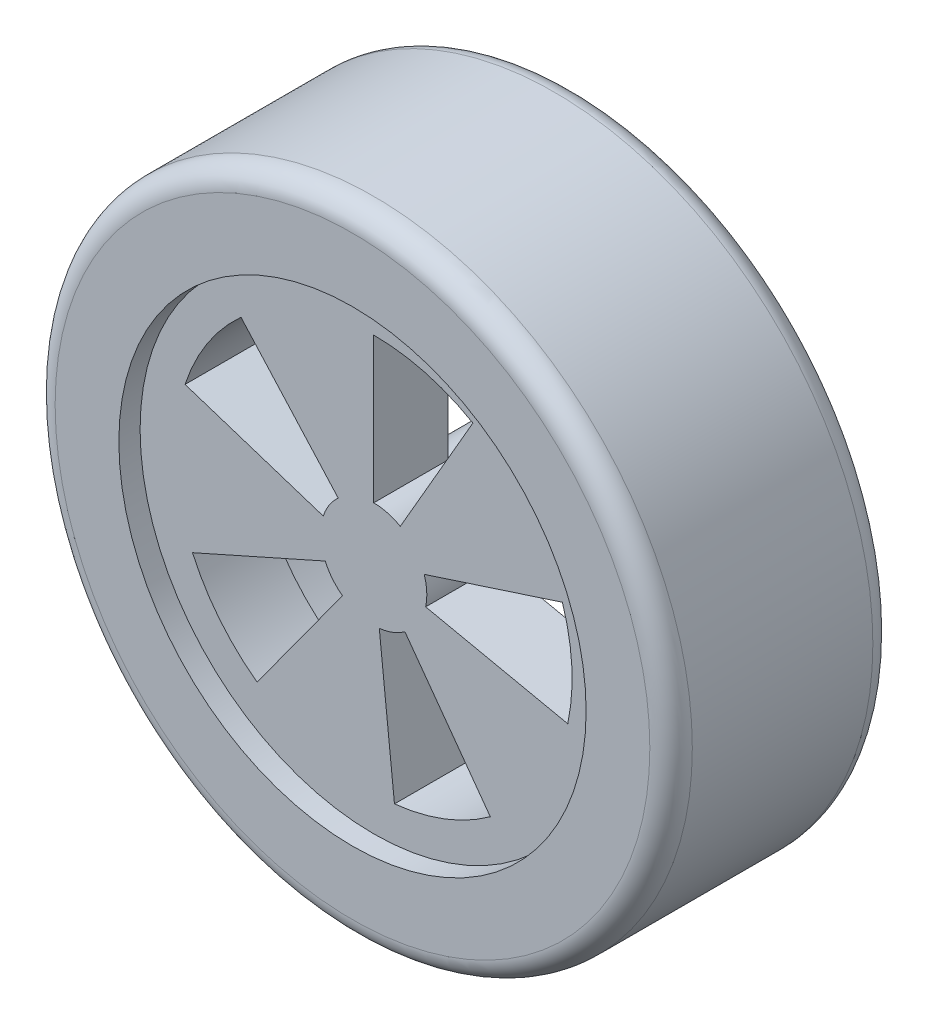
ISO-10303-21;
HEADER;
FILE_DESCRIPTION(('STEP AP214'),'2;1');
FILE_NAME('part.step','',(''),(''),'','','');
FILE_SCHEMA(('AUTOMOTIVE_DESIGN { 1 0 10303 214 1 1 1 1 }'));
ENDSEC;
DATA;
#1=APPLICATION_CONTEXT('core data for automotive mechanical design processes');
#2=APPLICATION_PROTOCOL_DEFINITION('international standard','automotive_design',2000,#1);
#3=PRODUCT_CONTEXT('',#1,'mechanical');
#4=PRODUCT('Part','Part','',(#3));
#5=PRODUCT_RELATED_PRODUCT_CATEGORY('part','',(#4));
#6=PRODUCT_DEFINITION_FORMATION('','',#4);
#7=PRODUCT_DEFINITION_CONTEXT('part definition',#1,'design');
#8=PRODUCT_DEFINITION('design','',#6,#7);
#9=PRODUCT_DEFINITION_SHAPE('','',#8);
#10=(LENGTH_UNIT() NAMED_UNIT(*) SI_UNIT(.MILLI.,.METRE.));
#11=(NAMED_UNIT(*) PLANE_ANGLE_UNIT() SI_UNIT($,.RADIAN.));
#12=(NAMED_UNIT(*) SI_UNIT($,.STERADIAN.) SOLID_ANGLE_UNIT());
#13=UNCERTAINTY_MEASURE_WITH_UNIT(LENGTH_MEASURE(1.E-05),#10,'distance_accuracy_value','');
#14=(GEOMETRIC_REPRESENTATION_CONTEXT(3) GLOBAL_UNCERTAINTY_ASSIGNED_CONTEXT((#13)) GLOBAL_UNIT_ASSIGNED_CONTEXT((#10,
#11,#12)) REPRESENTATION_CONTEXT('',''));
#15=CARTESIAN_POINT('',(0.,0.,0.));
#16=DIRECTION('',(0.,0.,1.));
#17=DIRECTION('',(1.,0.,0.));
#18=AXIS2_PLACEMENT_3D('',#15,#16,#17);
#19=CARTESIAN_POINT('',(0.,0.,10.5));
#20=DIRECTION('',(0.,0.,-1.));
#21=DIRECTION('',(-1.,0.,0.));
#22=AXIS2_PLACEMENT_3D('',#19,#20,#21);
#23=CYLINDRICAL_SURFACE('',#22,14.9999999999997);
#24=CARTESIAN_POINT('',(0.,0.,0.999999999999999));
#25=DIRECTION('',(0.,0.,1.));
#26=DIRECTION('',(1.,0.,0.));
#27=AXIS2_PLACEMENT_3D('',#24,#25,#26);
#28=CIRCLE('',#27,14.9999999999997);
#29=CARTESIAN_POINT('',(-14.9999999999997,0.,0.999999999999997));
#30=VERTEX_POINT('',#29);
#31=EDGE_CURVE('E339',#30,#30,#28,.T.);
#32=CARTESIAN_POINT('',(0.,0.,9.5));
#33=DIRECTION('',(0.,0.,1.));
#34=DIRECTION('',(1.,0.,0.));
#35=AXIS2_PLACEMENT_3D('',#32,#33,#34);
#36=CIRCLE('',#35,14.9999999999997);
#37=CARTESIAN_POINT('',(-14.9999999999997,0.,9.5));
#38=VERTEX_POINT('',#37);
#39=EDGE_CURVE('E334',#38,#38,#36,.F.);
#40=CARTESIAN_POINT('',(-14.9999999999997,0.,0.999999999999997));
#41=CARTESIAN_POINT('',(-14.9999999999997,0.,1.08854166666666));
#42=CARTESIAN_POINT('',(-14.9999999999997,0.,1.17708333333333));
#43=CARTESIAN_POINT('',(-14.9999999999997,0.,1.35416666666666));
#44=CARTESIAN_POINT('',(-14.9999999999997,0.,1.44270833333333));
#45=CARTESIAN_POINT('',(-14.9999999999997,0.,1.61979166666666));
#46=CARTESIAN_POINT('',(-14.9999999999997,0.,1.70833333333333));
#47=CARTESIAN_POINT('',(-14.9999999999997,0.,1.88541666666666));
#48=CARTESIAN_POINT('',(-14.9999999999997,0.,1.97395833333333));
#49=CARTESIAN_POINT('',(-14.9999999999997,0.,2.15104166666667));
#50=CARTESIAN_POINT('',(-14.9999999999997,0.,2.23958333333333));
#51=CARTESIAN_POINT('',(-14.9999999999997,0.,2.41666666666667));
#52=CARTESIAN_POINT('',(-14.9999999999997,0.,2.50520833333333));
#53=CARTESIAN_POINT('',(-14.9999999999997,0.,2.68229166666666));
#54=CARTESIAN_POINT('',(-14.9999999999997,0.,2.77083333333333));
#55=CARTESIAN_POINT('',(-14.9999999999997,0.,2.94791666666666));
#56=CARTESIAN_POINT('',(-14.9999999999997,0.,3.03645833333333));
#57=CARTESIAN_POINT('',(-14.9999999999997,0.,3.21354166666666));
#58=CARTESIAN_POINT('',(-14.9999999999997,0.,3.30208333333333));
#59=CARTESIAN_POINT('',(-14.9999999999997,0.,3.47916666666666));
#60=CARTESIAN_POINT('',(-14.9999999999997,0.,3.56770833333333));
#61=CARTESIAN_POINT('',(-14.9999999999997,0.,3.74479166666666));
#62=CARTESIAN_POINT('',(-14.9999999999997,0.,3.83333333333333));
#63=CARTESIAN_POINT('',(-14.9999999999997,0.,4.01041666666666));
#64=CARTESIAN_POINT('',(-14.9999999999997,0.,4.09895833333333));
#65=CARTESIAN_POINT('',(-14.9999999999997,0.,4.27604166666666));
#66=CARTESIAN_POINT('',(-14.9999999999997,0.,4.36458333333333));
#67=CARTESIAN_POINT('',(-14.9999999999997,0.,4.54166666666666));
#68=CARTESIAN_POINT('',(-14.9999999999997,0.,4.63020833333333));
#69=CARTESIAN_POINT('',(-14.9999999999997,0.,4.80729166666666));
#70=CARTESIAN_POINT('',(-14.9999999999997,0.,4.89583333333333));
#71=CARTESIAN_POINT('',(-14.9999999999997,0.,5.07291666666667));
#72=CARTESIAN_POINT('',(-14.9999999999997,0.,5.16145833333333));
#73=CARTESIAN_POINT('',(-14.9999999999997,0.,5.33854166666667));
#74=CARTESIAN_POINT('',(-14.9999999999997,0.,5.42708333333333));
#75=CARTESIAN_POINT('',(-14.9999999999997,0.,5.60416666666667));
#76=CARTESIAN_POINT('',(-14.9999999999997,0.,5.69270833333333));
#77=CARTESIAN_POINT('',(-14.9999999999997,0.,5.86979166666667));
#78=CARTESIAN_POINT('',(-14.9999999999997,0.,5.95833333333333));
#79=CARTESIAN_POINT('',(-14.9999999999997,0.,6.13541666666667));
#80=CARTESIAN_POINT('',(-14.9999999999997,0.,6.22395833333333));
#81=CARTESIAN_POINT('',(-14.9999999999997,0.,6.40104166666667));
#82=CARTESIAN_POINT('',(-14.9999999999997,0.,6.48958333333333));
#83=CARTESIAN_POINT('',(-14.9999999999997,0.,6.66666666666667));
#84=CARTESIAN_POINT('',(-14.9999999999997,0.,6.75520833333333));
#85=CARTESIAN_POINT('',(-14.9999999999997,0.,6.93229166666667));
#86=CARTESIAN_POINT('',(-14.9999999999997,0.,7.02083333333333));
#87=CARTESIAN_POINT('',(-14.9999999999997,0.,7.19791666666667));
#88=CARTESIAN_POINT('',(-14.9999999999997,0.,7.28645833333333));
#89=CARTESIAN_POINT('',(-14.9999999999997,0.,7.46354166666667));
#90=CARTESIAN_POINT('',(-14.9999999999997,0.,7.55208333333333));
#91=CARTESIAN_POINT('',(-14.9999999999997,0.,7.72916666666667));
#92=CARTESIAN_POINT('',(-14.9999999999997,0.,7.81770833333333));
#93=CARTESIAN_POINT('',(-14.9999999999997,0.,7.99479166666667));
#94=CARTESIAN_POINT('',(-14.9999999999997,0.,8.08333333333333));
#95=CARTESIAN_POINT('',(-14.9999999999997,0.,8.26041666666667));
#96=CARTESIAN_POINT('',(-14.9999999999997,0.,8.34895833333333));
#97=CARTESIAN_POINT('',(-14.9999999999997,0.,8.52604166666667));
#98=CARTESIAN_POINT('',(-14.9999999999997,0.,8.61458333333333));
#99=CARTESIAN_POINT('',(-14.9999999999997,0.,8.79166666666667));
#100=CARTESIAN_POINT('',(-14.9999999999997,0.,8.88020833333333));
#101=CARTESIAN_POINT('',(-14.9999999999997,0.,9.05729166666667));
#102=CARTESIAN_POINT('',(-14.9999999999997,0.,9.14583333333333));
#103=CARTESIAN_POINT('',(-14.9999999999997,0.,9.32291666666667));
#104=CARTESIAN_POINT('',(-14.9999999999997,0.,9.41145833333333));
#105=CARTESIAN_POINT('',(-14.9999999999997,0.,9.5));
#106=B_SPLINE_CURVE_WITH_KNOTS('',3,(#40,#41,#42,#43,#44,#45,#46,#47,#48,#49,#50,#51,#52,#53,
#54,#55,#56,#57,#58,#59,#60,#61,#62,#63,#64,#65,#66,#67,#68,#69,#70,#71,#72,#73,#74,#75,#76,#77,
#78,#79,#80,#81,#82,#83,#84,#85,#86,#87,#88,#89,#90,#91,#92,#93,#94,#95,#96,#97,#98,#99,#100,
#101,#102,#103,#104,#105),.UNSPECIFIED.,.F.,.F.,(4,2,2,2,2,2,2,2,2,2,2,2,2,2,2,2,2,2,2,2,2,2,2,
2,2,2,2,2,2,2,2,2,4),(0.,0.265625,0.53125,0.796875000000001,1.0625,1.328125,1.59375,1.859375,
2.125,2.390625,2.65625,2.921875,3.1875,3.453125,3.71875,3.984375,4.25,4.515625,4.78125,5.046875,
5.3125,5.578125,5.84375,6.109375,6.375,6.640625,6.90625,7.171875,7.4375,7.703125,7.96875,
8.234375,8.5),.UNSPECIFIED.);
#107=EDGE_CURVE('BSEAM43',#30,#38,#106,.T.);
#108=ORIENTED_EDGE('',*,*,#31,.T.);
#109=ORIENTED_EDGE('',*,*,#39,.T.);
#110=ORIENTED_EDGE('',*,*,#107,.T.);
#111=ORIENTED_EDGE('',*,*,#107,.F.);
#112=EDGE_LOOP('',(#108,#110,#109,#111));
#113=FACE_BOUND('',#112,.T.);
#114=ADVANCED_FACE('F43',(#113),#23,.T.);
#115=CARTESIAN_POINT('',(0.,0.,10.5));
#116=DIRECTION('',(0.,0.,1.));
#117=DIRECTION('',(1.,0.,0.));
#118=AXIS2_PLACEMENT_3D('',#115,#116,#117);
#119=PLANE('',#118);
#120=CARTESIAN_POINT('',(0.,0.,10.5));
#121=DIRECTION('',(0.,0.,1.));
#122=DIRECTION('',(1.,0.,0.));
#123=AXIS2_PLACEMENT_3D('',#120,#121,#122);
#124=CIRCLE('',#123,13.9999999999997);
#125=CARTESIAN_POINT('',(13.9999999999997,0.,10.5));
#126=VERTEX_POINT('',#125);
#127=EDGE_CURVE('E345',#126,#126,#124,.T.);
#128=ORIENTED_EDGE('',*,*,#127,.T.);
#129=EDGE_LOOP('',(#128));
#130=FACE_BOUND('',#129,.T.);
#131=CARTESIAN_POINT('',(0.,0.,10.5));
#132=DIRECTION('',(0.,0.,1.));
#133=DIRECTION('',(1.,0.,0.));
#134=AXIS2_PLACEMENT_3D('',#131,#132,#133);
#135=CIRCLE('',#134,11.);
#136=CARTESIAN_POINT('',(11.,0.,10.5));
#137=VERTEX_POINT('',#136);
#138=EDGE_CURVE('E328',#137,#137,#135,.T.);
#139=ORIENTED_EDGE('',*,*,#138,.F.);
#140=EDGE_LOOP('',(#139));
#141=FACE_BOUND('',#140,.T.);
#142=ADVANCED_FACE('F430',(#130,#141),#119,.T.);
#143=CARTESIAN_POINT('',(0.,0.,0.));
#144=DIRECTION('',(0.,0.,1.));
#145=DIRECTION('',(1.,0.,0.));
#146=AXIS2_PLACEMENT_3D('',#143,#144,#145);
#147=PLANE('',#146);
#148=CARTESIAN_POINT('',(0.,0.,0.));
#149=DIRECTION('',(0.,0.,1.));
#150=DIRECTION('',(1.,0.,0.));
#151=AXIS2_PLACEMENT_3D('',#148,#149,#150);
#152=CIRCLE('',#151,13.9999999999997);
#153=CARTESIAN_POINT('',(13.9999999999997,0.,0.));
#154=VERTEX_POINT('',#153);
#155=EDGE_CURVE('E342',#154,#154,#152,.F.);
#156=ORIENTED_EDGE('',*,*,#155,.T.);
#157=EDGE_LOOP('',(#156));
#158=FACE_BOUND('',#157,.T.);
#159=CARTESIAN_POINT('',(0.,0.,0.));
#160=DIRECTION('',(0.,0.,-1.));
#161=DIRECTION('',(-1.,0.,0.));
#162=AXIS2_PLACEMENT_3D('',#159,#160,#161);
#163=CIRCLE('',#162,12.);
#164=CARTESIAN_POINT('',(-12.,0.,0.));
#165=VERTEX_POINT('',#164);
#166=EDGE_CURVE('E319',#165,#165,#163,.T.);
#167=ORIENTED_EDGE('',*,*,#166,.F.);
#168=EDGE_LOOP('',(#167));
#169=FACE_BOUND('',#168,.T.);
#170=ADVANCED_FACE('F436',(#158,#169),#147,.F.);
#171=CARTESIAN_POINT('',(0.,0.,9.5));
#172=DIRECTION('',(0.,0.,1.));
#173=DIRECTION('',(1.,0.,0.));
#174=AXIS2_PLACEMENT_3D('',#171,#172,#173);
#175=CYLINDRICAL_SURFACE('',#174,11.);
#176=CARTESIAN_POINT('',(0.,0.,9.5));
#177=DIRECTION('',(0.,0.,1.));
#178=DIRECTION('',(1.,0.,0.));
#179=AXIS2_PLACEMENT_3D('',#176,#177,#178);
#180=CIRCLE('',#179,11.);
#181=CARTESIAN_POINT('',(11.,0.,9.5));
#182=VERTEX_POINT('',#181);
#183=EDGE_CURVE('E331',#182,#182,#180,.T.);
#184=ORIENTED_EDGE('',*,*,#183,.F.);
#185=EDGE_LOOP('',(#184));
#186=FACE_BOUND('',#185,.T.);
#187=ORIENTED_EDGE('',*,*,#138,.T.);
#188=EDGE_LOOP('',(#187));
#189=FACE_BOUND('',#188,.T.);
#190=ADVANCED_FACE('F407',(#186,#189),#175,.F.);
#191=CARTESIAN_POINT('',(0.,0.,9.5));
#192=DIRECTION('',(0.,0.,1.));
#193=DIRECTION('',(1.,0.,0.));
#194=AXIS2_PLACEMENT_3D('',#191,#192,#193);
#195=PLANE('',#194);
#196=CARTESIAN_POINT('',(0.,0.,9.5));
#197=DIRECTION('',(0.,0.,-1.));
#198=DIRECTION('',(1.,0.,0.));
#199=AXIS2_PLACEMENT_3D('',#196,#197,#198);
#200=CIRCLE('',#199,2.5);
#201=CARTESIAN_POINT('',(-2.37764129073788,0.772542485937395,9.5));
#202=VERTEX_POINT('',#201);
#203=CARTESIAN_POINT('',(-1.67282651589712,1.85786206369351,9.5));
#204=VERTEX_POINT('',#203);
#205=EDGE_CURVE('E58',#202,#204,#200,.T.);
#206=ORIENTED_EDGE('',*,*,#205,.F.);
#207=DIRECTION('',(0.95105651629515,-0.309016994374958,0.));
#208=VECTOR('',#207,1.);
#209=CARTESIAN_POINT('',(-2.37764129073788,0.772542485937395,9.5));
#210=LINE('',#209,#208);
#211=CARTESIAN_POINT('',(-8.88249697552788,2.88609821907834,9.5));
#212=VERTEX_POINT('',#211);
#213=EDGE_CURVE('E263',#212,#202,#210,.T.);
#214=ORIENTED_EDGE('',*,*,#213,.F.);
#215=CARTESIAN_POINT('',(0.,0.,9.5));
#216=DIRECTION('',(0.,0.,1.));
#217=DIRECTION('',(1.,0.,0.));
#218=AXIS2_PLACEMENT_3D('',#215,#216,#217);
#219=CIRCLE('',#218,9.33961002667827);
#220=CARTESIAN_POINT('',(-6.24941892030641,6.94068286330282,9.5));
#221=VERTEX_POINT('',#220);
#222=EDGE_CURVE('E260',#221,#212,#219,.T.);
#223=ORIENTED_EDGE('',*,*,#222,.F.);
#224=DIRECTION('',(-0.669130606358849,0.743144825477403,0.));
#225=VECTOR('',#224,1.);
#226=CARTESIAN_POINT('',(-1.67282651589712,1.85786206369351,9.5));
#227=LINE('',#226,#225);
#228=EDGE_CURVE('E257',#204,#221,#227,.T.);
#229=ORIENTED_EDGE('',*,*,#228,.F.);
#230=EDGE_LOOP('',(#206,#214,#223,#229));
#231=FACE_BOUND('',#230,.T.);
#232=CARTESIAN_POINT('',(0.,0.,9.5));
#233=DIRECTION('',(0.,0.,-1.));
#234=DIRECTION('',(1.,0.,0.));
#235=AXIS2_PLACEMENT_3D('',#232,#233,#234);
#236=CIRCLE('',#235,2.5);
#237=CARTESIAN_POINT('',(-1.4694631307312,-2.02254248593736,9.5));
#238=VERTEX_POINT('',#237);
#239=CARTESIAN_POINT('',(-2.28386364410651,-1.01684160768948,9.5));
#240=VERTEX_POINT('',#239);
#241=EDGE_CURVE('E65',#238,#240,#236,.T.);
#242=ORIENTED_EDGE('',*,*,#241,.F.);
#243=DIRECTION('',(0.58778525229248,0.809016994374942,0.));
#244=VECTOR('',#243,1.);
#245=CARTESIAN_POINT('',(-1.4694631307312,-2.02254248593736,9.5));
#246=LINE('',#245,#244);
#247=CARTESIAN_POINT('',(-5.48968503584446,-7.55590323241732,9.5));
#248=VERTEX_POINT('',#247);
#249=EDGE_CURVE('E246',#248,#238,#246,.T.);
#250=ORIENTED_EDGE('',*,*,#249,.F.);
#251=CARTESIAN_POINT('',(0.,0.,9.5));
#252=DIRECTION('',(0.,0.,1.));
#253=DIRECTION('',(1.,0.,0.));
#254=AXIS2_PLACEMENT_3D('',#251,#252,#253);
#255=CIRCLE('',#254,9.33961002667827);
#256=CARTESIAN_POINT('',(-8.53215831602526,-3.79876162988812,9.5));
#257=VERTEX_POINT('',#256);
#258=EDGE_CURVE('E243',#257,#248,#255,.T.);
#259=ORIENTED_EDGE('',*,*,#258,.F.);
#260=DIRECTION('',(-0.913545457642605,-0.406736643075791,0.));
#261=VECTOR('',#260,1.);
#262=CARTESIAN_POINT('',(-2.28386364410651,-1.01684160768948,9.5));
#263=LINE('',#262,#261);
#264=EDGE_CURVE('E239',#240,#257,#263,.T.);
#265=ORIENTED_EDGE('',*,*,#264,.F.);
#266=EDGE_LOOP('',(#242,#250,#259,#265));
#267=FACE_BOUND('',#266,.T.);
#268=CARTESIAN_POINT('',(0.,0.,9.5));
#269=DIRECTION('',(0.,0.,-1.));
#270=DIRECTION('',(1.,0.,0.));
#271=AXIS2_PLACEMENT_3D('',#268,#269,#270);
#272=CIRCLE('',#271,2.5);
#273=CARTESIAN_POINT('',(1.46946313073117,-2.02254248593738,9.5));
#274=VERTEX_POINT('',#273);
#275=CARTESIAN_POINT('',(0.261321158169116,-2.48630473842069,9.5));
#276=VERTEX_POINT('',#275);
#277=EDGE_CURVE('E217',#274,#276,#272,.T.);
#278=ORIENTED_EDGE('',*,*,#277,.F.);
#279=DIRECTION('',(-0.587785252292469,0.809016994374951,0.));
#280=VECTOR('',#279,1.);
#281=CARTESIAN_POINT('',(1.46946313073117,-2.02254248593738,9.5));
#282=LINE('',#281,#280);
#283=CARTESIAN_POINT('',(5.48968503584435,-7.5559032324174,9.5));
#284=VERTEX_POINT('',#283);
#285=EDGE_CURVE('E226',#284,#274,#282,.T.);
#286=ORIENTED_EDGE('',*,*,#285,.F.);
#287=CARTESIAN_POINT('',(0.,0.,9.5));
#288=DIRECTION('',(0.,0.,1.));
#289=DIRECTION('',(1.,0.,0.));
#290=AXIS2_PLACEMENT_3D('',#287,#288,#289);
#291=CIRCLE('',#290,9.33961002667827);
#292=CARTESIAN_POINT('',(0.976255083607785,-9.28844666573261,9.5));
#293=VERTEX_POINT('',#292);
#294=EDGE_CURVE('E223',#293,#284,#291,.T.);
#295=ORIENTED_EDGE('',*,*,#294,.F.);
#296=DIRECTION('',(0.104528463267647,-0.994521895368274,0.));
#297=VECTOR('',#296,1.);
#298=CARTESIAN_POINT('',(0.261321158169116,-2.48630473842069,9.5));
#299=LINE('',#298,#297);
#300=EDGE_CURVE('E219',#276,#293,#299,.T.);
#301=ORIENTED_EDGE('',*,*,#300,.F.);
#302=EDGE_LOOP('',(#278,#286,#295,#301));
#303=FACE_BOUND('',#302,.T.);
#304=CARTESIAN_POINT('',(0.,0.,9.5));
#305=DIRECTION('',(0.,0.,-1.));
#306=DIRECTION('',(1.,0.,0.));
#307=AXIS2_PLACEMENT_3D('',#304,#305,#306);
#308=CIRCLE('',#307,2.5);
#309=CARTESIAN_POINT('',(2.37764129073789,0.772542485937362,9.5));
#310=VERTEX_POINT('',#309);
#311=CARTESIAN_POINT('',(2.44536900183451,-0.519779227044408,9.5));
#312=VERTEX_POINT('',#311);
#313=EDGE_CURVE('E202',#310,#312,#308,.T.);
#314=ORIENTED_EDGE('',*,*,#313,.F.);
#315=DIRECTION('',(-0.951056516295154,-0.309016994374945,0.));
#316=VECTOR('',#315,1.);
#317=CARTESIAN_POINT('',(2.37764129073789,0.772542485937362,9.5));
#318=LINE('',#317,#316);
#319=CARTESIAN_POINT('',(8.88249697552793,2.88609821907822,9.5));
#320=VERTEX_POINT('',#319);
#321=EDGE_CURVE('E207',#320,#310,#318,.T.);
#322=ORIENTED_EDGE('',*,*,#321,.F.);
#323=CARTESIAN_POINT('',(0.,0.,9.5));
#324=DIRECTION('',(0.,0.,1.));
#325=DIRECTION('',(1.,0.,0.));
#326=AXIS2_PLACEMENT_3D('',#323,#324,#325);
#327=CIRCLE('',#326,9.33961002667827);
#328=CARTESIAN_POINT('',(9.13551713938473,-1.94181411222521,9.5));
#329=VERTEX_POINT('',#328);
#330=EDGE_CURVE('E186',#329,#320,#327,.T.);
#331=ORIENTED_EDGE('',*,*,#330,.F.);
#332=DIRECTION('',(0.978147600733805,-0.207911690817763,0.));
#333=VECTOR('',#332,1.);
#334=CARTESIAN_POINT('',(2.44536900183451,-0.519779227044408,9.5));
#335=LINE('',#334,#333);
#336=EDGE_CURVE('E197',#312,#329,#335,.T.);
#337=ORIENTED_EDGE('',*,*,#336,.F.);
#338=EDGE_LOOP('',(#314,#322,#331,#337));
#339=FACE_BOUND('',#338,.T.);
#340=CARTESIAN_POINT('',(0.,0.,9.5));
#341=DIRECTION('',(0.,0.,-1.));
#342=DIRECTION('',(1.,0.,0.));
#343=AXIS2_PLACEMENT_3D('',#340,#341,#342);
#344=CIRCLE('',#343,2.5);
#345=CARTESIAN_POINT('',(0.,2.5,9.5));
#346=VERTEX_POINT('',#345);
#347=CARTESIAN_POINT('',(1.25,2.1650635094611,9.5));
#348=VERTEX_POINT('',#347);
#349=EDGE_CURVE('E214',#346,#348,#344,.T.);
#350=ORIENTED_EDGE('',*,*,#349,.F.);
#351=DIRECTION('',(0.,-1.,0.));
#352=VECTOR('',#351,1.);
#353=CARTESIAN_POINT('',(0.,2.5,9.5));
#354=LINE('',#353,#352);
#355=CARTESIAN_POINT('',(0.,9.33961002667827,9.5));
#356=VERTEX_POINT('',#355);
#357=EDGE_CURVE('E280',#356,#346,#354,.T.);
#358=ORIENTED_EDGE('',*,*,#357,.F.);
#359=CARTESIAN_POINT('',(0.,0.,9.5));
#360=DIRECTION('',(0.,0.,1.));
#361=DIRECTION('',(1.,0.,0.));
#362=AXIS2_PLACEMENT_3D('',#359,#360,#361);
#363=CIRCLE('',#362,9.33961002667827);
#364=CARTESIAN_POINT('',(4.66980501333914,8.08833954454323,9.5));
#365=VERTEX_POINT('',#364);
#366=EDGE_CURVE('E277',#365,#356,#363,.T.);
#367=ORIENTED_EDGE('',*,*,#366,.F.);
#368=DIRECTION('',(0.500000000000001,0.866025403784438,0.));
#369=VECTOR('',#368,1.);
#370=CARTESIAN_POINT('',(1.25,2.1650635094611,9.5));
#371=LINE('',#370,#369);
#372=EDGE_CURVE('E274',#348,#365,#371,.T.);
#373=ORIENTED_EDGE('',*,*,#372,.F.);
#374=EDGE_LOOP('',(#350,#358,#367,#373));
#375=FACE_BOUND('',#374,.T.);
#376=ORIENTED_EDGE('',*,*,#183,.T.);
#377=EDGE_LOOP('',(#376));
#378=FACE_BOUND('',#377,.T.);
#379=ADVANCED_FACE('F204',(#231,#267,#303,#339,#375,#378),#195,.T.);
#380=CARTESIAN_POINT('',(0.,0.,6.));
#381=DIRECTION('',(0.,0.,-1.));
#382=DIRECTION('',(-1.,0.,0.));
#383=AXIS2_PLACEMENT_3D('',#380,#381,#382);
#384=CYLINDRICAL_SURFACE('',#383,2.5);
#385=CARTESIAN_POINT('',(0.,0.,6.));
#386=DIRECTION('',(0.,0.,-1.));
#387=DIRECTION('',(-1.,0.,0.));
#388=AXIS2_PLACEMENT_3D('',#385,#386,#387);
#389=CIRCLE('',#388,2.5);
#390=CARTESIAN_POINT('',(-2.28386364410651,-1.01684160768948,6.));
#391=VERTEX_POINT('',#390);
#392=CARTESIAN_POINT('',(-2.37764129073788,0.772542485937395,6.));
#393=VERTEX_POINT('',#392);
#394=EDGE_CURVE('E320',#391,#393,#389,.T.);
#395=ORIENTED_EDGE('',*,*,#394,.T.);
#396=DIRECTION('',(0.,0.,1.));
#397=VECTOR('',#396,1.);
#398=CARTESIAN_POINT('',(-2.37764129073788,0.772542485937395,-2.5));
#399=LINE('',#398,#397);
#400=EDGE_CURVE('E240',#393,#202,#399,.T.);
#401=ORIENTED_EDGE('',*,*,#400,.T.);
#402=ORIENTED_EDGE('',*,*,#205,.T.);
#403=DIRECTION('',(0.,0.,1.));
#404=VECTOR('',#403,1.);
#405=CARTESIAN_POINT('',(-1.67282651589712,1.85786206369351,-2.5));
#406=LINE('',#405,#404);
#407=CARTESIAN_POINT('',(-1.67282651589712,1.85786206369351,6.));
#408=VERTEX_POINT('',#407);
#409=EDGE_CURVE('E266',#408,#204,#406,.T.);
#410=ORIENTED_EDGE('',*,*,#409,.F.);
#411=CARTESIAN_POINT('',(0.,2.5,6.));
#412=VERTEX_POINT('',#411);
#413=EDGE_CURVE('E324',#408,#412,#389,.T.);
#414=ORIENTED_EDGE('',*,*,#413,.T.);
#415=DIRECTION('',(0.,0.,1.));
#416=VECTOR('',#415,1.);
#417=CARTESIAN_POINT('',(0.,2.5,-2.5));
#418=LINE('',#417,#416);
#419=EDGE_CURVE('E284',#412,#346,#418,.T.);
#420=ORIENTED_EDGE('',*,*,#419,.T.);
#421=ORIENTED_EDGE('',*,*,#349,.T.);
#422=DIRECTION('',(0.,0.,1.));
#423=VECTOR('',#422,1.);
#424=CARTESIAN_POINT('',(1.25,2.1650635094611,-2.5));
#425=LINE('',#424,#423);
#426=CARTESIAN_POINT('',(1.25,2.1650635094611,6.));
#427=VERTEX_POINT('',#426);
#428=EDGE_CURVE('E283',#427,#348,#425,.T.);
#429=ORIENTED_EDGE('',*,*,#428,.F.);
#430=CARTESIAN_POINT('',(2.37764129073789,0.772542485937362,6.));
#431=VERTEX_POINT('',#430);
#432=EDGE_CURVE('E389',#427,#431,#389,.T.);
#433=ORIENTED_EDGE('',*,*,#432,.T.);
#434=DIRECTION('',(0.,0.,1.));
#435=VECTOR('',#434,1.);
#436=CARTESIAN_POINT('',(2.37764129073789,0.772542485937362,-2.5));
#437=LINE('',#436,#435);
#438=EDGE_CURVE('E212',#431,#310,#437,.T.);
#439=ORIENTED_EDGE('',*,*,#438,.T.);
#440=ORIENTED_EDGE('',*,*,#313,.T.);
#441=DIRECTION('',(0.,0.,1.));
#442=VECTOR('',#441,1.);
#443=CARTESIAN_POINT('',(2.44536900183451,-0.519779227044408,-2.5));
#444=LINE('',#443,#442);
#445=CARTESIAN_POINT('',(2.44536900183451,-0.519779227044408,6.));
#446=VERTEX_POINT('',#445);
#447=EDGE_CURVE('E193',#446,#312,#444,.T.);
#448=ORIENTED_EDGE('',*,*,#447,.F.);
#449=CARTESIAN_POINT('',(1.46946313073117,-2.02254248593738,6.));
#450=VERTEX_POINT('',#449);
#451=EDGE_CURVE('E391',#446,#450,#389,.T.);
#452=ORIENTED_EDGE('',*,*,#451,.T.);
#453=DIRECTION('',(0.,0.,1.));
#454=VECTOR('',#453,1.);
#455=CARTESIAN_POINT('',(1.46946313073117,-2.02254248593738,-2.5));
#456=LINE('',#455,#454);
#457=EDGE_CURVE('E230',#450,#274,#456,.T.);
#458=ORIENTED_EDGE('',*,*,#457,.T.);
#459=ORIENTED_EDGE('',*,*,#277,.T.);
#460=DIRECTION('',(0.,0.,1.));
#461=VECTOR('',#460,1.);
#462=CARTESIAN_POINT('',(0.261321158169116,-2.48630473842069,-2.5));
#463=LINE('',#462,#461);
#464=CARTESIAN_POINT('',(0.261321158169116,-2.48630473842069,6.));
#465=VERTEX_POINT('',#464);
#466=EDGE_CURVE('E229',#465,#276,#463,.T.);
#467=ORIENTED_EDGE('',*,*,#466,.F.);
#468=CARTESIAN_POINT('',(-1.4694631307312,-2.02254248593736,6.));
#469=VERTEX_POINT('',#468);
#470=EDGE_CURVE('E323',#465,#469,#389,.T.);
#471=ORIENTED_EDGE('',*,*,#470,.T.);
#472=DIRECTION('',(0.,0.,1.));
#473=VECTOR('',#472,1.);
#474=CARTESIAN_POINT('',(-1.4694631307312,-2.02254248593736,-2.5));
#475=LINE('',#474,#473);
#476=EDGE_CURVE('E220',#469,#238,#475,.T.);
#477=ORIENTED_EDGE('',*,*,#476,.T.);
#478=ORIENTED_EDGE('',*,*,#241,.T.);
#479=DIRECTION('',(0.,0.,1.));
#480=VECTOR('',#479,1.);
#481=CARTESIAN_POINT('',(-2.28386364410651,-1.01684160768948,-2.5));
#482=LINE('',#481,#480);
#483=EDGE_CURVE('E249',#391,#240,#482,.T.);
#484=ORIENTED_EDGE('',*,*,#483,.F.);
#485=EDGE_LOOP('',(#395,#401,#402,#410,#414,#420,#421,#429,#433,#439,#440,#448,#452,#458,#459,
#467,#471,#477,#478,#484));
#486=FACE_BOUND('',#485,.T.);
#487=CARTESIAN_POINT('',(0.,0.,-2.5));
#488=DIRECTION('',(0.,0.,-1.));
#489=DIRECTION('',(-1.,0.,0.));
#490=AXIS2_PLACEMENT_3D('',#487,#488,#489);
#491=CIRCLE('',#490,2.5);
#492=CARTESIAN_POINT('',(-2.5,0.,-2.5));
#493=VERTEX_POINT('',#492);
#494=EDGE_CURVE('E313',#493,#493,#491,.T.);
#495=ORIENTED_EDGE('',*,*,#494,.F.);
#496=EDGE_LOOP('',(#495));
#497=FACE_BOUND('',#496,.T.);
#498=ADVANCED_FACE('F371',(#486,#497),#384,.T.);
#499=CARTESIAN_POINT('',(0.,0.,6.));
#500=DIRECTION('',(0.,0.,-1.));
#501=DIRECTION('',(-1.,0.,0.));
#502=AXIS2_PLACEMENT_3D('',#499,#500,#501);
#503=CYLINDRICAL_SURFACE('',#502,12.);
#504=CARTESIAN_POINT('',(0.,0.,6.));
#505=DIRECTION('',(0.,0.,-1.));
#506=DIRECTION('',(-1.,0.,0.));
#507=AXIS2_PLACEMENT_3D('',#504,#505,#506);
#508=CIRCLE('',#507,12.);
#509=CARTESIAN_POINT('',(-12.,0.,6.));
#510=VERTEX_POINT('',#509);
#511=EDGE_CURVE('E325',#510,#510,#508,.T.);
#512=ORIENTED_EDGE('',*,*,#511,.F.);
#513=EDGE_LOOP('',(#512));
#514=FACE_BOUND('',#513,.T.);
#515=ORIENTED_EDGE('',*,*,#166,.T.);
#516=EDGE_LOOP('',(#515));
#517=FACE_BOUND('',#516,.T.);
#518=ADVANCED_FACE('F462',(#514,#517),#503,.F.);
#519=CARTESIAN_POINT('',(0.,0.,6.));
#520=DIRECTION('',(0.,0.,-1.));
#521=DIRECTION('',(-1.,0.,0.));
#522=AXIS2_PLACEMENT_3D('',#519,#520,#521);
#523=PLANE('',#522);
#524=DIRECTION('',(-0.95105651629515,0.309016994374958,0.));
#525=VECTOR('',#524,1.);
#526=CARTESIAN_POINT('',(0.,0.,6.));
#527=LINE('',#526,#525);
#528=CARTESIAN_POINT('',(-8.88249697552788,2.88609821907834,6.));
#529=VERTEX_POINT('',#528);
#530=EDGE_CURVE('E308',#393,#529,#527,.T.);
#531=ORIENTED_EDGE('',*,*,#530,.F.);
#532=ORIENTED_EDGE('',*,*,#394,.F.);
#533=DIRECTION('',(0.913545457642605,0.406736643075791,0.));
#534=VECTOR('',#533,1.);
#535=CARTESIAN_POINT('',(0.,0.,6.));
#536=LINE('',#535,#534);
#537=CARTESIAN_POINT('',(-8.53215831602526,-3.79876162988812,6.));
#538=VERTEX_POINT('',#537);
#539=EDGE_CURVE('E302',#538,#391,#536,.T.);
#540=ORIENTED_EDGE('',*,*,#539,.F.);
#541=CARTESIAN_POINT('',(0.,0.,6.));
#542=DIRECTION('',(0.,0.,-1.));
#543=DIRECTION('',(-1.,0.,0.));
#544=AXIS2_PLACEMENT_3D('',#541,#542,#543);
#545=CIRCLE('',#544,9.33961002667827);
#546=CARTESIAN_POINT('',(-5.48968503584446,-7.55590323241732,6.));
#547=VERTEX_POINT('',#546);
#548=EDGE_CURVE('E51',#547,#538,#545,.T.);
#549=ORIENTED_EDGE('',*,*,#548,.F.);
#550=DIRECTION('',(-0.58778525229248,-0.809016994374942,0.));
#551=VECTOR('',#550,1.);
#552=CARTESIAN_POINT('',(0.,0.,6.));
#553=LINE('',#552,#551);
#554=EDGE_CURVE('E304',#469,#547,#553,.T.);
#555=ORIENTED_EDGE('',*,*,#554,.F.);
#556=ORIENTED_EDGE('',*,*,#470,.F.);
#557=DIRECTION('',(-0.104528463267647,0.994521895368274,0.));
#558=VECTOR('',#557,1.);
#559=CARTESIAN_POINT('',(0.,0.,6.));
#560=LINE('',#559,#558);
#561=CARTESIAN_POINT('',(0.976255083607782,-9.28844666573261,6.));
#562=VERTEX_POINT('',#561);
#563=EDGE_CURVE('E298',#562,#465,#560,.T.);
#564=ORIENTED_EDGE('',*,*,#563,.F.);
#565=CARTESIAN_POINT('',(0.,0.,6.));
#566=DIRECTION('',(0.,0.,-1.));
#567=DIRECTION('',(-1.,0.,0.));
#568=AXIS2_PLACEMENT_3D('',#565,#566,#567);
#569=CIRCLE('',#568,9.33961002667827);
#570=CARTESIAN_POINT('',(5.48968503584435,-7.5559032324174,6.));
#571=VERTEX_POINT('',#570);
#572=EDGE_CURVE('E354',#571,#562,#569,.T.);
#573=ORIENTED_EDGE('',*,*,#572,.F.);
#574=DIRECTION('',(0.587785252292469,-0.809016994374951,0.));
#575=VECTOR('',#574,1.);
#576=CARTESIAN_POINT('',(0.,0.,6.));
#577=LINE('',#576,#575);
#578=EDGE_CURVE('E300',#450,#571,#577,.T.);
#579=ORIENTED_EDGE('',*,*,#578,.F.);
#580=ORIENTED_EDGE('',*,*,#451,.F.);
#581=DIRECTION('',(-0.978147600733805,0.207911690817763,0.));
#582=VECTOR('',#581,1.);
#583=CARTESIAN_POINT('',(0.,0.,6.));
#584=LINE('',#583,#582);
#585=CARTESIAN_POINT('',(9.13551713938473,-1.94181411222521,6.));
#586=VERTEX_POINT('',#585);
#587=EDGE_CURVE('E294',#586,#446,#584,.T.);
#588=ORIENTED_EDGE('',*,*,#587,.F.);
#589=CARTESIAN_POINT('',(0.,0.,6.));
#590=DIRECTION('',(0.,0.,-1.));
#591=DIRECTION('',(-1.,0.,0.));
#592=AXIS2_PLACEMENT_3D('',#589,#590,#591);
#593=CIRCLE('',#592,9.33961002667827);
#594=CARTESIAN_POINT('',(8.88249697552793,2.88609821907822,6.));
#595=VERTEX_POINT('',#594);
#596=EDGE_CURVE('E189',#595,#586,#593,.T.);
#597=ORIENTED_EDGE('',*,*,#596,.F.);
#598=DIRECTION('',(0.951056516295155,0.309016994374945,0.));
#599=VECTOR('',#598,1.);
#600=CARTESIAN_POINT('',(0.,0.,6.));
#601=LINE('',#600,#599);
#602=EDGE_CURVE('E296',#431,#595,#601,.T.);
#603=ORIENTED_EDGE('',*,*,#602,.F.);
#604=ORIENTED_EDGE('',*,*,#432,.F.);
#605=DIRECTION('',(-0.500000000000001,-0.866025403784438,0.));
#606=VECTOR('',#605,1.);
#607=CARTESIAN_POINT('',(0.,0.,6.));
#608=LINE('',#607,#606);
#609=CARTESIAN_POINT('',(4.66980501333914,8.08833954454323,6.));
#610=VERTEX_POINT('',#609);
#611=EDGE_CURVE('E286',#610,#427,#608,.T.);
#612=ORIENTED_EDGE('',*,*,#611,.F.);
#613=CARTESIAN_POINT('',(0.,0.,6.));
#614=DIRECTION('',(0.,0.,-1.));
#615=DIRECTION('',(-1.,0.,0.));
#616=AXIS2_PLACEMENT_3D('',#613,#614,#615);
#617=CIRCLE('',#616,9.33961002667827);
#618=CARTESIAN_POINT('',(0.,9.33961002667827,6.));
#619=VERTEX_POINT('',#618);
#620=EDGE_CURVE('E348',#619,#610,#617,.T.);
#621=ORIENTED_EDGE('',*,*,#620,.F.);
#622=DIRECTION('',(0.,1.,0.));
#623=VECTOR('',#622,1.);
#624=CARTESIAN_POINT('',(0.,0.,6.));
#625=LINE('',#624,#623);
#626=EDGE_CURVE('E351',#412,#619,#625,.T.);
#627=ORIENTED_EDGE('',*,*,#626,.F.);
#628=ORIENTED_EDGE('',*,*,#413,.F.);
#629=DIRECTION('',(0.669130606358849,-0.743144825477403,0.));
#630=VECTOR('',#629,1.);
#631=CARTESIAN_POINT('',(0.,0.,6.));
#632=LINE('',#631,#630);
#633=CARTESIAN_POINT('',(-6.24941892030641,6.94068286330282,6.));
#634=VERTEX_POINT('',#633);
#635=EDGE_CURVE('E306',#634,#408,#632,.T.);
#636=ORIENTED_EDGE('',*,*,#635,.F.);
#637=CARTESIAN_POINT('',(0.,0.,6.));
#638=DIRECTION('',(0.,0.,-1.));
#639=DIRECTION('',(-1.,0.,0.));
#640=AXIS2_PLACEMENT_3D('',#637,#638,#639);
#641=CIRCLE('',#640,9.33961002667827);
#642=EDGE_CURVE('E12',#529,#634,#641,.T.);
#643=ORIENTED_EDGE('',*,*,#642,.F.);
#644=EDGE_LOOP('',(#531,#532,#540,#549,#555,#556,#564,#573,#579,#580,#588,#597,#603,#604,#612,
#621,#627,#628,#636,#643));
#645=FACE_BOUND('',#644,.T.);
#646=ORIENTED_EDGE('',*,*,#511,.T.);
#647=EDGE_LOOP('',(#646));
#648=FACE_BOUND('',#647,.T.);
#649=ADVANCED_FACE('F366',(#645,#648),#523,.T.);
#650=CARTESIAN_POINT('',(0.,0.,-2.5));
#651=DIRECTION('',(0.,0.,-1.));
#652=DIRECTION('',(-1.,0.,0.));
#653=AXIS2_PLACEMENT_3D('',#650,#651,#652);
#654=PLANE('',#653);
#655=CARTESIAN_POINT('',(0.,0.,-2.5));
#656=DIRECTION('',(0.,0.,-1.));
#657=DIRECTION('',(-1.,0.,0.));
#658=AXIS2_PLACEMENT_3D('',#655,#656,#657);
#659=CIRCLE('',#658,1.);
#660=CARTESIAN_POINT('',(-1.,0.,-2.5));
#661=VERTEX_POINT('',#660);
#662=EDGE_CURVE('E310',#661,#661,#659,.T.);
#663=ORIENTED_EDGE('',*,*,#662,.F.);
#664=EDGE_LOOP('',(#663));
#665=FACE_BOUND('',#664,.T.);
#666=ORIENTED_EDGE('',*,*,#494,.T.);
#667=EDGE_LOOP('',(#666));
#668=FACE_BOUND('',#667,.T.);
#669=ADVANCED_FACE('F470',(#665,#668),#654,.T.);
#670=CARTESIAN_POINT('',(0.,0.,6.));
#671=DIRECTION('',(0.,0.,-1.));
#672=DIRECTION('',(-1.,0.,0.));
#673=AXIS2_PLACEMENT_3D('',#670,#671,#672);
#674=PLANE('',#673);
#675=CARTESIAN_POINT('',(0.,0.,6.));
#676=DIRECTION('',(0.,0.,-1.));
#677=DIRECTION('',(-1.,0.,0.));
#678=AXIS2_PLACEMENT_3D('',#675,#676,#677);
#679=CIRCLE('',#678,1.);
#680=CARTESIAN_POINT('',(-1.,0.,6.));
#681=VERTEX_POINT('',#680);
#682=EDGE_CURVE('E316',#681,#681,#679,.T.);
#683=ORIENTED_EDGE('',*,*,#682,.T.);
#684=EDGE_LOOP('',(#683));
#685=FACE_BOUND('',#684,.T.);
#686=ADVANCED_FACE('F451',(#685),#674,.T.);
#687=CARTESIAN_POINT('',(0.,0.,6.));
#688=DIRECTION('',(0.,0.,-1.));
#689=DIRECTION('',(-1.,0.,0.));
#690=AXIS2_PLACEMENT_3D('',#687,#688,#689);
#691=CYLINDRICAL_SURFACE('',#690,1.);
#692=ORIENTED_EDGE('',*,*,#682,.F.);
#693=EDGE_LOOP('',(#692));
#694=FACE_BOUND('',#693,.T.);
#695=ORIENTED_EDGE('',*,*,#662,.T.);
#696=EDGE_LOOP('',(#695));
#697=FACE_BOUND('',#696,.T.);
#698=ADVANCED_FACE('F443',(#694,#697),#691,.F.);
#699=CARTESIAN_POINT('',(0.,0.,0.999999999999999));
#700=DIRECTION('',(0.,0.,1.));
#701=DIRECTION('',(1.,0.,0.));
#702=AXIS2_PLACEMENT_3D('',#699,#700,#701);
#703=TOROIDAL_SURFACE('',#702,13.9999999999997,1.);
#704=ORIENTED_EDGE('',*,*,#155,.F.);
#705=EDGE_LOOP('',(#704));
#706=FACE_BOUND('',#705,.T.);
#707=ORIENTED_EDGE('',*,*,#31,.F.);
#708=EDGE_LOOP('',(#707));
#709=FACE_BOUND('',#708,.T.);
#710=ADVANCED_FACE('F441',(#706,#709),#703,.T.);
#711=CARTESIAN_POINT('',(0.,0.,9.5));
#712=DIRECTION('',(0.,0.,1.));
#713=DIRECTION('',(1.,0.,0.));
#714=AXIS2_PLACEMENT_3D('',#711,#712,#713);
#715=TOROIDAL_SURFACE('',#714,13.9999999999997,1.);
#716=ORIENTED_EDGE('',*,*,#39,.F.);
#717=EDGE_LOOP('',(#716));
#718=FACE_BOUND('',#717,.T.);
#719=ORIENTED_EDGE('',*,*,#127,.F.);
#720=EDGE_LOOP('',(#719));
#721=FACE_BOUND('',#720,.T.);
#722=ADVANCED_FACE('F45',(#718,#721),#715,.T.);
#723=CARTESIAN_POINT('',(0.,2.5,-2.5));
#724=DIRECTION('',(-1.,0.,0.));
#725=DIRECTION('',(0.,0.,1.));
#726=AXIS2_PLACEMENT_3D('',#723,#724,#725);
#727=PLANE('',#726);
#728=ORIENTED_EDGE('',*,*,#626,.T.);
#729=DIRECTION('',(0.,0.,1.));
#730=VECTOR('',#729,1.);
#731=CARTESIAN_POINT('',(0.,9.33961002667827,-2.5));
#732=LINE('',#731,#730);
#733=EDGE_CURVE('E287',#619,#356,#732,.T.);
#734=ORIENTED_EDGE('',*,*,#733,.T.);
#735=ORIENTED_EDGE('',*,*,#357,.T.);
#736=ORIENTED_EDGE('',*,*,#419,.F.);
#737=EDGE_LOOP('',(#728,#734,#735,#736));
#738=FACE_BOUND('',#737,.T.);
#739=ADVANCED_FACE('F449',(#738),#727,.F.);
#740=CARTESIAN_POINT('',(0.,0.,-2.5));
#741=DIRECTION('',(0.,0.,1.));
#742=DIRECTION('',(1.,0.,0.));
#743=AXIS2_PLACEMENT_3D('',#740,#741,#742);
#744=CYLINDRICAL_SURFACE('',#743,9.33961002667827);
#745=ORIENTED_EDGE('',*,*,#620,.T.);
#746=DIRECTION('',(0.,0.,1.));
#747=VECTOR('',#746,1.);
#748=CARTESIAN_POINT('',(4.66980501333914,8.08833954454323,-2.5));
#749=LINE('',#748,#747);
#750=EDGE_CURVE('E289',#610,#365,#749,.T.);
#751=ORIENTED_EDGE('',*,*,#750,.T.);
#752=ORIENTED_EDGE('',*,*,#366,.T.);
#753=ORIENTED_EDGE('',*,*,#733,.F.);
#754=EDGE_LOOP('',(#745,#751,#752,#753));
#755=FACE_BOUND('',#754,.T.);
#756=ADVANCED_FACE('F543',(#755),#744,.F.);
#757=CARTESIAN_POINT('',(1.25,2.1650635094611,-2.5));
#758=DIRECTION('',(0.866025403784438,-0.500000000000001,0.));
#759=DIRECTION('',(0.500000000000001,0.866025403784438,0.));
#760=AXIS2_PLACEMENT_3D('',#757,#758,#759);
#761=PLANE('',#760);
#762=ORIENTED_EDGE('',*,*,#611,.T.);
#763=ORIENTED_EDGE('',*,*,#428,.T.);
#764=ORIENTED_EDGE('',*,*,#372,.T.);
#765=ORIENTED_EDGE('',*,*,#750,.F.);
#766=EDGE_LOOP('',(#762,#763,#764,#765));
#767=FACE_BOUND('',#766,.T.);
#768=ADVANCED_FACE('F560',(#767),#761,.F.);
#769=CARTESIAN_POINT('',(2.37764129073789,0.772542485937362,-2.5));
#770=DIRECTION('',(-0.309016994374945,0.951056516295154,0.));
#771=DIRECTION('',(-0.951056516295155,-0.309016994374945,0.));
#772=AXIS2_PLACEMENT_3D('',#769,#770,#771);
#773=PLANE('',#772);
#774=ORIENTED_EDGE('',*,*,#602,.T.);
#775=DIRECTION('',(0.,0.,1.));
#776=VECTOR('',#775,1.);
#777=CARTESIAN_POINT('',(8.88249697552793,2.88609821907822,-2.5));
#778=LINE('',#777,#776);
#779=EDGE_CURVE('E192',#595,#320,#778,.T.);
#780=ORIENTED_EDGE('',*,*,#779,.T.);
#781=ORIENTED_EDGE('',*,*,#321,.T.);
#782=ORIENTED_EDGE('',*,*,#438,.F.);
#783=EDGE_LOOP('',(#774,#780,#781,#782));
#784=FACE_BOUND('',#783,.T.);
#785=ADVANCED_FACE('F568',(#784),#773,.F.);
#786=CARTESIAN_POINT('',(0.,0.,-2.5));
#787=DIRECTION('',(0.,0.,1.));
#788=DIRECTION('',(1.,0.,0.));
#789=AXIS2_PLACEMENT_3D('',#786,#787,#788);
#790=CYLINDRICAL_SURFACE('',#789,9.33961002667827);
#791=ORIENTED_EDGE('',*,*,#596,.T.);
#792=DIRECTION('',(0.,0.,1.));
#793=VECTOR('',#792,1.);
#794=CARTESIAN_POINT('',(9.13551713938473,-1.94181411222521,-2.5));
#795=LINE('',#794,#793);
#796=EDGE_CURVE('E181',#586,#329,#795,.T.);
#797=ORIENTED_EDGE('',*,*,#796,.T.);
#798=ORIENTED_EDGE('',*,*,#330,.T.);
#799=ORIENTED_EDGE('',*,*,#779,.F.);
#800=EDGE_LOOP('',(#791,#797,#798,#799));
#801=FACE_BOUND('',#800,.T.);
#802=ADVANCED_FACE('F183',(#801),#790,.F.);
#803=CARTESIAN_POINT('',(2.44536900183451,-0.519779227044408,-2.5));
#804=DIRECTION('',(-0.207911690817763,-0.978147600733805,0.));
#805=DIRECTION('',(0.978147600733805,-0.207911690817763,0.));
#806=AXIS2_PLACEMENT_3D('',#803,#804,#805);
#807=PLANE('',#806);
#808=ORIENTED_EDGE('',*,*,#587,.T.);
#809=ORIENTED_EDGE('',*,*,#447,.T.);
#810=ORIENTED_EDGE('',*,*,#336,.T.);
#811=ORIENTED_EDGE('',*,*,#796,.F.);
#812=EDGE_LOOP('',(#808,#809,#810,#811));
#813=FACE_BOUND('',#812,.T.);
#814=ADVANCED_FACE('F198',(#813),#807,.F.);
#815=CARTESIAN_POINT('',(1.46946313073117,-2.02254248593738,-2.5));
#816=DIRECTION('',(0.809016994374951,0.587785252292469,0.));
#817=DIRECTION('',(-0.587785252292469,0.809016994374951,0.));
#818=AXIS2_PLACEMENT_3D('',#815,#816,#817);
#819=PLANE('',#818);
#820=ORIENTED_EDGE('',*,*,#578,.T.);
#821=DIRECTION('',(0.,0.,1.));
#822=VECTOR('',#821,1.);
#823=CARTESIAN_POINT('',(5.48968503584435,-7.5559032324174,-2.5));
#824=LINE('',#823,#822);
#825=EDGE_CURVE('E232',#571,#284,#824,.T.);
#826=ORIENTED_EDGE('',*,*,#825,.T.);
#827=ORIENTED_EDGE('',*,*,#285,.T.);
#828=ORIENTED_EDGE('',*,*,#457,.F.);
#829=EDGE_LOOP('',(#820,#826,#827,#828));
#830=FACE_BOUND('',#829,.T.);
#831=ADVANCED_FACE('F420',(#830),#819,.F.);
#832=CARTESIAN_POINT('',(0.,0.,-2.5));
#833=DIRECTION('',(0.,0.,1.));
#834=DIRECTION('',(1.,0.,0.));
#835=AXIS2_PLACEMENT_3D('',#832,#833,#834);
#836=CYLINDRICAL_SURFACE('',#835,9.33961002667827);
#837=ORIENTED_EDGE('',*,*,#572,.T.);
#838=DIRECTION('',(0.,0.,1.));
#839=VECTOR('',#838,1.);
#840=CARTESIAN_POINT('',(0.976255083607785,-9.28844666573261,-2.5));
#841=LINE('',#840,#839);
#842=EDGE_CURVE('E234',#562,#293,#841,.T.);
#843=ORIENTED_EDGE('',*,*,#842,.T.);
#844=ORIENTED_EDGE('',*,*,#294,.T.);
#845=ORIENTED_EDGE('',*,*,#825,.F.);
#846=EDGE_LOOP('',(#837,#843,#844,#845));
#847=FACE_BOUND('',#846,.T.);
#848=ADVANCED_FACE('F417',(#847),#836,.F.);
#849=CARTESIAN_POINT('',(0.261321158169116,-2.48630473842069,-2.5));
#850=DIRECTION('',(-0.994521895368274,-0.104528463267647,0.));
#851=DIRECTION('',(0.104528463267647,-0.994521895368274,0.));
#852=AXIS2_PLACEMENT_3D('',#849,#850,#851);
#853=PLANE('',#852);
#854=ORIENTED_EDGE('',*,*,#563,.T.);
#855=ORIENTED_EDGE('',*,*,#466,.T.);
#856=ORIENTED_EDGE('',*,*,#300,.T.);
#857=ORIENTED_EDGE('',*,*,#842,.F.);
#858=EDGE_LOOP('',(#854,#855,#856,#857));
#859=FACE_BOUND('',#858,.T.);
#860=ADVANCED_FACE('F414',(#859),#853,.F.);
#861=CARTESIAN_POINT('',(-1.4694631307312,-2.02254248593736,-2.5));
#862=DIRECTION('',(0.809016994374942,-0.58778525229248,0.));
#863=DIRECTION('',(0.58778525229248,0.809016994374942,0.));
#864=AXIS2_PLACEMENT_3D('',#861,#862,#863);
#865=PLANE('',#864);
#866=ORIENTED_EDGE('',*,*,#554,.T.);
#867=DIRECTION('',(0.,0.,1.));
#868=VECTOR('',#867,1.);
#869=CARTESIAN_POINT('',(-5.48968503584446,-7.55590323241732,-2.5));
#870=LINE('',#869,#868);
#871=EDGE_CURVE('E251',#547,#248,#870,.T.);
#872=ORIENTED_EDGE('',*,*,#871,.T.);
#873=ORIENTED_EDGE('',*,*,#249,.T.);
#874=ORIENTED_EDGE('',*,*,#476,.F.);
#875=EDGE_LOOP('',(#866,#872,#873,#874));
#876=FACE_BOUND('',#875,.T.);
#877=ADVANCED_FACE('F402',(#876),#865,.F.);
#878=CARTESIAN_POINT('',(0.,0.,-2.5));
#879=DIRECTION('',(0.,0.,1.));
#880=DIRECTION('',(1.,0.,0.));
#881=AXIS2_PLACEMENT_3D('',#878,#879,#880);
#882=CYLINDRICAL_SURFACE('',#881,9.33961002667827);
#883=ORIENTED_EDGE('',*,*,#548,.T.);
#884=DIRECTION('',(0.,0.,1.));
#885=VECTOR('',#884,1.);
#886=CARTESIAN_POINT('',(-8.53215831602526,-3.79876162988812,-2.5));
#887=LINE('',#886,#885);
#888=EDGE_CURVE('E253',#538,#257,#887,.T.);
#889=ORIENTED_EDGE('',*,*,#888,.T.);
#890=ORIENTED_EDGE('',*,*,#258,.T.);
#891=ORIENTED_EDGE('',*,*,#871,.F.);
#892=EDGE_LOOP('',(#883,#889,#890,#891));
#893=FACE_BOUND('',#892,.T.);
#894=ADVANCED_FACE('F361',(#893),#882,.F.);
#895=CARTESIAN_POINT('',(-2.28386364410651,-1.01684160768948,-2.5));
#896=DIRECTION('',(-0.406736643075791,0.913545457642605,0.));
#897=DIRECTION('',(-0.913545457642605,-0.406736643075791,0.));
#898=AXIS2_PLACEMENT_3D('',#895,#896,#897);
#899=PLANE('',#898);
#900=ORIENTED_EDGE('',*,*,#539,.T.);
#901=ORIENTED_EDGE('',*,*,#483,.T.);
#902=ORIENTED_EDGE('',*,*,#264,.T.);
#903=ORIENTED_EDGE('',*,*,#888,.F.);
#904=EDGE_LOOP('',(#900,#901,#902,#903));
#905=FACE_BOUND('',#904,.T.);
#906=ADVANCED_FACE('F369',(#905),#899,.F.);
#907=CARTESIAN_POINT('',(-2.37764129073788,0.772542485937395,-2.5));
#908=DIRECTION('',(-0.309016994374958,-0.95105651629515,0.));
#909=DIRECTION('',(0.95105651629515,-0.309016994374958,0.));
#910=AXIS2_PLACEMENT_3D('',#907,#908,#909);
#911=PLANE('',#910);
#912=ORIENTED_EDGE('',*,*,#530,.T.);
#913=DIRECTION('',(0.,0.,1.));
#914=VECTOR('',#913,1.);
#915=CARTESIAN_POINT('',(-8.88249697552788,2.88609821907834,-2.5));
#916=LINE('',#915,#914);
#917=EDGE_CURVE('E268',#529,#212,#916,.T.);
#918=ORIENTED_EDGE('',*,*,#917,.T.);
#919=ORIENTED_EDGE('',*,*,#213,.T.);
#920=ORIENTED_EDGE('',*,*,#400,.F.);
#921=EDGE_LOOP('',(#912,#918,#919,#920));
#922=FACE_BOUND('',#921,.T.);
#923=ADVANCED_FACE('F375',(#922),#911,.F.);
#924=CARTESIAN_POINT('',(0.,0.,-2.5));
#925=DIRECTION('',(0.,0.,1.));
#926=DIRECTION('',(1.,0.,0.));
#927=AXIS2_PLACEMENT_3D('',#924,#925,#926);
#928=CYLINDRICAL_SURFACE('',#927,9.33961002667827);
#929=ORIENTED_EDGE('',*,*,#642,.T.);
#930=DIRECTION('',(0.,0.,1.));
#931=VECTOR('',#930,1.);
#932=CARTESIAN_POINT('',(-6.24941892030641,6.94068286330282,-2.5));
#933=LINE('',#932,#931);
#934=EDGE_CURVE('E270',#634,#221,#933,.T.);
#935=ORIENTED_EDGE('',*,*,#934,.T.);
#936=ORIENTED_EDGE('',*,*,#222,.T.);
#937=ORIENTED_EDGE('',*,*,#917,.F.);
#938=EDGE_LOOP('',(#929,#935,#936,#937));
#939=FACE_BOUND('',#938,.T.);
#940=ADVANCED_FACE('F505',(#939),#928,.F.);
#941=CARTESIAN_POINT('',(-1.67282651589712,1.85786206369351,-2.5));
#942=DIRECTION('',(0.743144825477403,0.669130606358849,0.));
#943=DIRECTION('',(-0.669130606358849,0.743144825477403,0.));
#944=AXIS2_PLACEMENT_3D('',#941,#942,#943);
#945=PLANE('',#944);
#946=ORIENTED_EDGE('',*,*,#635,.T.);
#947=ORIENTED_EDGE('',*,*,#409,.T.);
#948=ORIENTED_EDGE('',*,*,#228,.T.);
#949=ORIENTED_EDGE('',*,*,#934,.F.);
#950=EDGE_LOOP('',(#946,#947,#948,#949));
#951=FACE_BOUND('',#950,.T.);
#952=ADVANCED_FACE('F382',(#951),#945,.F.);
#953=CLOSED_SHELL('',(#114,#142,#170,#190,#379,#498,#518,#649,#669,#686,#698,#710,#722,#739,
#756,#768,#785,#802,#814,#831,#848,#860,#877,#894,#906,#923,#940,#952));
#954=MANIFOLD_SOLID_BREP('B2',#953);
#955=ADVANCED_BREP_SHAPE_REPRESENTATION('',(#18,#954),#14);
#956=SHAPE_DEFINITION_REPRESENTATION(#9,#955);
ENDSEC;
END-ISO-10303-21;
